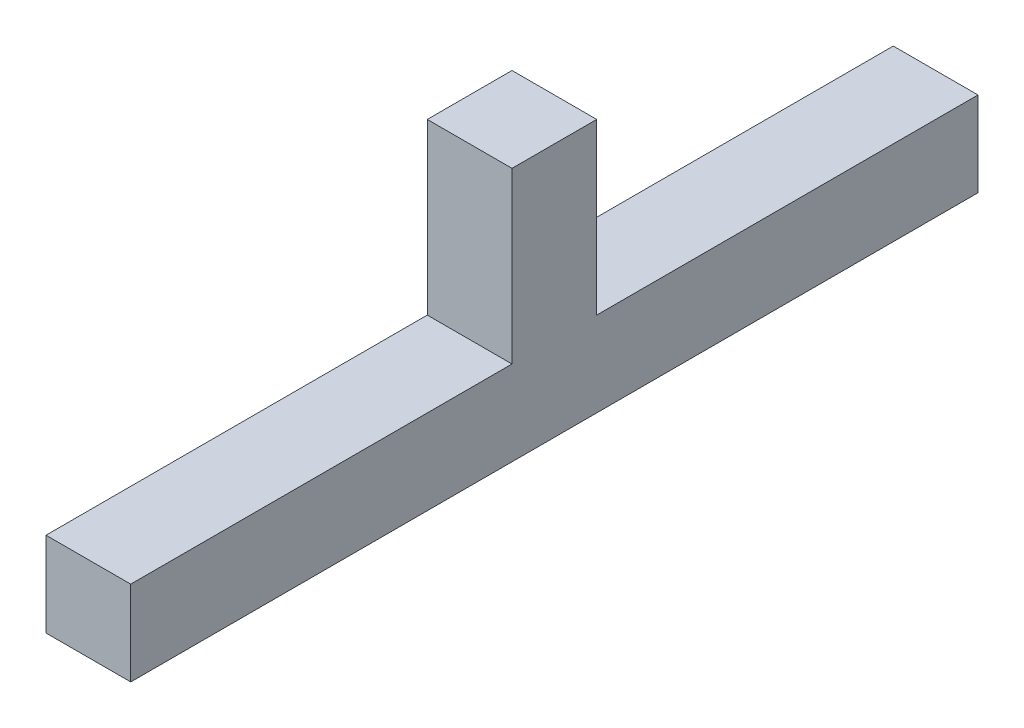
ISO-10303-21;
HEADER;
FILE_DESCRIPTION(('STEP AP214'),'2;1');
FILE_NAME('part.step','',(''),(''),'','','');
FILE_SCHEMA(('AUTOMOTIVE_DESIGN { 1 0 10303 214 1 1 1 1 }'));
ENDSEC;
DATA;
#1=APPLICATION_CONTEXT('core data for automotive mechanical design processes');
#2=APPLICATION_PROTOCOL_DEFINITION('international standard','automotive_design',2000,#1);
#3=PRODUCT_CONTEXT('',#1,'mechanical');
#4=PRODUCT('Part','Part','',(#3));
#5=PRODUCT_RELATED_PRODUCT_CATEGORY('part','',(#4));
#6=PRODUCT_DEFINITION_FORMATION('','',#4);
#7=PRODUCT_DEFINITION_CONTEXT('part definition',#1,'design');
#8=PRODUCT_DEFINITION('design','',#6,#7);
#9=PRODUCT_DEFINITION_SHAPE('','',#8);
#10=(LENGTH_UNIT() NAMED_UNIT(*) SI_UNIT(.MILLI.,.METRE.));
#11=(NAMED_UNIT(*) PLANE_ANGLE_UNIT() SI_UNIT($,.RADIAN.));
#12=(NAMED_UNIT(*) SI_UNIT($,.STERADIAN.) SOLID_ANGLE_UNIT());
#13=UNCERTAINTY_MEASURE_WITH_UNIT(LENGTH_MEASURE(1.E-05),#10,'distance_accuracy_value','');
#14=(GEOMETRIC_REPRESENTATION_CONTEXT(3) GLOBAL_UNCERTAINTY_ASSIGNED_CONTEXT((#13)) GLOBAL_UNIT_ASSIGNED_CONTEXT((#10,
#11,#12)) REPRESENTATION_CONTEXT('',''));
#15=CARTESIAN_POINT('',(0.,0.,0.));
#16=DIRECTION('',(0.,0.,1.));
#17=DIRECTION('',(1.,0.,0.));
#18=AXIS2_PLACEMENT_3D('',#15,#16,#17);
#19=CARTESIAN_POINT('',(5.,0.,0.));
#20=DIRECTION('',(0.,0.,1.));
#21=DIRECTION('',(1.,0.,0.));
#22=AXIS2_PLACEMENT_3D('',#19,#20,#21);
#23=PLANE('',#22);
#24=DIRECTION('',(0.,1.,0.));
#25=VECTOR('',#24,1.);
#26=CARTESIAN_POINT('',(0.,0.,0.));
#27=LINE('',#26,#25);
#28=CARTESIAN_POINT('',(0.,0.,0.));
#29=VERTEX_POINT('',#28);
#30=CARTESIAN_POINT('',(0.,5.,0.));
#31=VERTEX_POINT('',#30);
#32=EDGE_CURVE('E132',#29,#31,#27,.T.);
#33=ORIENTED_EDGE('',*,*,#32,.T.);
#34=DIRECTION('',(-1.,0.,0.));
#35=VECTOR('',#34,1.);
#36=CARTESIAN_POINT('',(5.,5.,0.));
#37=LINE('',#36,#35);
#38=CARTESIAN_POINT('',(5.,5.,0.));
#39=VERTEX_POINT('',#38);
#40=EDGE_CURVE('E11',#39,#31,#37,.T.);
#41=ORIENTED_EDGE('',*,*,#40,.F.);
#42=DIRECTION('',(0.,1.,0.));
#43=VECTOR('',#42,1.);
#44=CARTESIAN_POINT('',(5.,0.,0.));
#45=LINE('',#44,#43);
#46=CARTESIAN_POINT('',(5.,0.,0.));
#47=VERTEX_POINT('',#46);
#48=EDGE_CURVE('E146',#47,#39,#45,.T.);
#49=ORIENTED_EDGE('',*,*,#48,.F.);
#50=DIRECTION('',(-1.,0.,0.));
#51=VECTOR('',#50,1.);
#52=CARTESIAN_POINT('',(5.,0.,0.));
#53=LINE('',#52,#51);
#54=EDGE_CURVE('E128',#47,#29,#53,.T.);
#55=ORIENTED_EDGE('',*,*,#54,.T.);
#56=EDGE_LOOP('',(#33,#41,#49,#55));
#57=FACE_BOUND('',#56,.T.);
#58=ADVANCED_FACE('F36',(#57),#23,.F.);
#59=CARTESIAN_POINT('',(5.,5.,22.5));
#60=DIRECTION('',(0.,-1.,0.));
#61=DIRECTION('',(0.,0.,-1.));
#62=AXIS2_PLACEMENT_3D('',#59,#60,#61);
#63=PLANE('',#62);
#64=DIRECTION('',(0.,0.,1.));
#65=VECTOR('',#64,1.);
#66=CARTESIAN_POINT('',(0.,5.,22.5));
#67=LINE('',#66,#65);
#68=CARTESIAN_POINT('',(0.,5.,22.5));
#69=VERTEX_POINT('',#68);
#70=EDGE_CURVE('E135',#31,#69,#67,.T.);
#71=ORIENTED_EDGE('',*,*,#70,.T.);
#72=DIRECTION('',(-1.,0.,0.));
#73=VECTOR('',#72,1.);
#74=CARTESIAN_POINT('',(5.,5.,22.5));
#75=LINE('',#74,#73);
#76=CARTESIAN_POINT('',(5.,5.,22.5));
#77=VERTEX_POINT('',#76);
#78=EDGE_CURVE('E44',#77,#69,#75,.T.);
#79=ORIENTED_EDGE('',*,*,#78,.F.);
#80=DIRECTION('',(0.,0.,1.));
#81=VECTOR('',#80,1.);
#82=CARTESIAN_POINT('',(5.,5.,22.5));
#83=LINE('',#82,#81);
#84=EDGE_CURVE('E95',#39,#77,#83,.T.);
#85=ORIENTED_EDGE('',*,*,#84,.F.);
#86=ORIENTED_EDGE('',*,*,#40,.T.);
#87=EDGE_LOOP('',(#71,#79,#85,#86));
#88=FACE_BOUND('',#87,.T.);
#89=ADVANCED_FACE('F181',(#88),#63,.F.);
#90=CARTESIAN_POINT('',(5.,15.,22.5));
#91=DIRECTION('',(0.,0.,1.));
#92=DIRECTION('',(1.,0.,0.));
#93=AXIS2_PLACEMENT_3D('',#90,#91,#92);
#94=PLANE('',#93);
#95=DIRECTION('',(0.,1.,0.));
#96=VECTOR('',#95,1.);
#97=CARTESIAN_POINT('',(0.,15.,22.5));
#98=LINE('',#97,#96);
#99=CARTESIAN_POINT('',(0.,15.,22.5));
#100=VERTEX_POINT('',#99);
#101=EDGE_CURVE('E137',#69,#100,#98,.T.);
#102=ORIENTED_EDGE('',*,*,#101,.T.);
#103=DIRECTION('',(-1.,0.,0.));
#104=VECTOR('',#103,1.);
#105=CARTESIAN_POINT('',(5.,15.,22.5));
#106=LINE('',#105,#104);
#107=CARTESIAN_POINT('',(5.,15.,22.5));
#108=VERTEX_POINT('',#107);
#109=EDGE_CURVE('E153',#108,#100,#106,.T.);
#110=ORIENTED_EDGE('',*,*,#109,.F.);
#111=DIRECTION('',(0.,1.,0.));
#112=VECTOR('',#111,1.);
#113=CARTESIAN_POINT('',(5.,15.,22.5));
#114=LINE('',#113,#112);
#115=EDGE_CURVE('E161',#77,#108,#114,.T.);
#116=ORIENTED_EDGE('',*,*,#115,.F.);
#117=ORIENTED_EDGE('',*,*,#78,.T.);
#118=EDGE_LOOP('',(#102,#110,#116,#117));
#119=FACE_BOUND('',#118,.T.);
#120=ADVANCED_FACE('F159',(#119),#94,.F.);
#121=CARTESIAN_POINT('',(5.,15.,22.5));
#122=DIRECTION('',(0.,-1.,0.));
#123=DIRECTION('',(0.,0.,-1.));
#124=AXIS2_PLACEMENT_3D('',#121,#122,#123);
#125=PLANE('',#124);
#126=DIRECTION('',(0.,0.,1.));
#127=VECTOR('',#126,1.);
#128=CARTESIAN_POINT('',(0.,15.,22.5));
#129=LINE('',#128,#127);
#130=CARTESIAN_POINT('',(0.,15.,27.5));
#131=VERTEX_POINT('',#130);
#132=EDGE_CURVE('E139',#100,#131,#129,.T.);
#133=ORIENTED_EDGE('',*,*,#132,.T.);
#134=DIRECTION('',(-1.,0.,0.));
#135=VECTOR('',#134,1.);
#136=CARTESIAN_POINT('',(5.,15.,27.5));
#137=LINE('',#136,#135);
#138=CARTESIAN_POINT('',(5.,15.,27.5));
#139=VERTEX_POINT('',#138);
#140=EDGE_CURVE('E150',#139,#131,#137,.T.);
#141=ORIENTED_EDGE('',*,*,#140,.F.);
#142=DIRECTION('',(0.,0.,1.));
#143=VECTOR('',#142,1.);
#144=CARTESIAN_POINT('',(5.,15.,22.5));
#145=LINE('',#144,#143);
#146=EDGE_CURVE('E173',#108,#139,#145,.T.);
#147=ORIENTED_EDGE('',*,*,#146,.F.);
#148=ORIENTED_EDGE('',*,*,#109,.T.);
#149=EDGE_LOOP('',(#133,#141,#147,#148));
#150=FACE_BOUND('',#149,.T.);
#151=ADVANCED_FACE('F169',(#150),#125,.F.);
#152=CARTESIAN_POINT('',(5.,4.99999999999999,27.5));
#153=DIRECTION('',(0.,0.,-1.));
#154=DIRECTION('',(-1.,0.,0.));
#155=AXIS2_PLACEMENT_3D('',#152,#153,#154);
#156=PLANE('',#155);
#157=DIRECTION('',(0.,-1.,0.));
#158=VECTOR('',#157,1.);
#159=CARTESIAN_POINT('',(0.,4.99999999999999,27.5));
#160=LINE('',#159,#158);
#161=CARTESIAN_POINT('',(0.,4.99999999999999,27.5));
#162=VERTEX_POINT('',#161);
#163=EDGE_CURVE('E141',#131,#162,#160,.T.);
#164=ORIENTED_EDGE('',*,*,#163,.T.);
#165=DIRECTION('',(-1.,0.,0.));
#166=VECTOR('',#165,1.);
#167=CARTESIAN_POINT('',(5.,4.99999999999999,27.5));
#168=LINE('',#167,#166);
#169=CARTESIAN_POINT('',(5.,4.99999999999999,27.5));
#170=VERTEX_POINT('',#169);
#171=EDGE_CURVE('E123',#170,#162,#168,.T.);
#172=ORIENTED_EDGE('',*,*,#171,.F.);
#173=DIRECTION('',(0.,-1.,0.));
#174=VECTOR('',#173,1.);
#175=CARTESIAN_POINT('',(5.,4.99999999999999,27.5));
#176=LINE('',#175,#174);
#177=EDGE_CURVE('E114',#139,#170,#176,.T.);
#178=ORIENTED_EDGE('',*,*,#177,.F.);
#179=ORIENTED_EDGE('',*,*,#140,.T.);
#180=EDGE_LOOP('',(#164,#172,#178,#179));
#181=FACE_BOUND('',#180,.T.);
#182=ADVANCED_FACE('F172',(#181),#156,.F.);
#183=CARTESIAN_POINT('',(5.,4.99999999999999,50.));
#184=DIRECTION('',(0.,-1.,0.));
#185=DIRECTION('',(0.,0.,-1.));
#186=AXIS2_PLACEMENT_3D('',#183,#184,#185);
#187=PLANE('',#186);
#188=DIRECTION('',(0.,0.,1.));
#189=VECTOR('',#188,1.);
#190=CARTESIAN_POINT('',(0.,4.99999999999999,50.));
#191=LINE('',#190,#189);
#192=CARTESIAN_POINT('',(0.,4.99999999999999,50.));
#193=VERTEX_POINT('',#192);
#194=EDGE_CURVE('E122',#162,#193,#191,.T.);
#195=ORIENTED_EDGE('',*,*,#194,.T.);
#196=DIRECTION('',(-1.,0.,0.));
#197=VECTOR('',#196,1.);
#198=CARTESIAN_POINT('',(5.,4.99999999999999,50.));
#199=LINE('',#198,#197);
#200=CARTESIAN_POINT('',(5.,4.99999999999999,50.));
#201=VERTEX_POINT('',#200);
#202=EDGE_CURVE('E119',#201,#193,#199,.T.);
#203=ORIENTED_EDGE('',*,*,#202,.F.);
#204=DIRECTION('',(0.,0.,1.));
#205=VECTOR('',#204,1.);
#206=CARTESIAN_POINT('',(5.,4.99999999999999,50.));
#207=LINE('',#206,#205);
#208=EDGE_CURVE('E108',#170,#201,#207,.T.);
#209=ORIENTED_EDGE('',*,*,#208,.F.);
#210=ORIENTED_EDGE('',*,*,#171,.T.);
#211=EDGE_LOOP('',(#195,#203,#209,#210));
#212=FACE_BOUND('',#211,.T.);
#213=ADVANCED_FACE('F120',(#212),#187,.F.);
#214=CARTESIAN_POINT('',(5.,0.,50.));
#215=DIRECTION('',(0.,0.,-1.));
#216=DIRECTION('',(-1.,0.,0.));
#217=AXIS2_PLACEMENT_3D('',#214,#215,#216);
#218=PLANE('',#217);
#219=DIRECTION('',(0.,-1.,0.));
#220=VECTOR('',#219,1.);
#221=CARTESIAN_POINT('',(0.,0.,50.));
#222=LINE('',#221,#220);
#223=CARTESIAN_POINT('',(0.,0.,50.));
#224=VERTEX_POINT('',#223);
#225=EDGE_CURVE('E81',#193,#224,#222,.T.);
#226=ORIENTED_EDGE('',*,*,#225,.T.);
#227=DIRECTION('',(-1.,0.,0.));
#228=VECTOR('',#227,1.);
#229=CARTESIAN_POINT('',(5.,0.,50.));
#230=LINE('',#229,#228);
#231=CARTESIAN_POINT('',(5.,0.,50.));
#232=VERTEX_POINT('',#231);
#233=EDGE_CURVE('E124',#232,#224,#230,.T.);
#234=ORIENTED_EDGE('',*,*,#233,.F.);
#235=DIRECTION('',(0.,-1.,0.));
#236=VECTOR('',#235,1.);
#237=CARTESIAN_POINT('',(5.,0.,50.));
#238=LINE('',#237,#236);
#239=EDGE_CURVE('E112',#201,#232,#238,.T.);
#240=ORIENTED_EDGE('',*,*,#239,.F.);
#241=ORIENTED_EDGE('',*,*,#202,.T.);
#242=EDGE_LOOP('',(#226,#234,#240,#241));
#243=FACE_BOUND('',#242,.T.);
#244=ADVANCED_FACE('F126',(#243),#218,.F.);
#245=CARTESIAN_POINT('',(5.,0.,0.));
#246=DIRECTION('',(0.,1.,0.));
#247=DIRECTION('',(0.,0.,1.));
#248=AXIS2_PLACEMENT_3D('',#245,#246,#247);
#249=PLANE('',#248);
#250=DIRECTION('',(0.,0.,-1.));
#251=VECTOR('',#250,1.);
#252=CARTESIAN_POINT('',(0.,0.,0.));
#253=LINE('',#252,#251);
#254=EDGE_CURVE('E87',#224,#29,#253,.T.);
#255=ORIENTED_EDGE('',*,*,#254,.T.);
#256=ORIENTED_EDGE('',*,*,#54,.F.);
#257=DIRECTION('',(0.,0.,-1.));
#258=VECTOR('',#257,1.);
#259=CARTESIAN_POINT('',(5.,0.,0.));
#260=LINE('',#259,#258);
#261=EDGE_CURVE('E52',#232,#47,#260,.T.);
#262=ORIENTED_EDGE('',*,*,#261,.F.);
#263=ORIENTED_EDGE('',*,*,#233,.T.);
#264=EDGE_LOOP('',(#255,#256,#262,#263));
#265=FACE_BOUND('',#264,.T.);
#266=ADVANCED_FACE('F197',(#265),#249,.F.);
#267=CARTESIAN_POINT('',(5.,0.,0.));
#268=DIRECTION('',(-1.,0.,0.));
#269=DIRECTION('',(0.,0.,1.));
#270=AXIS2_PLACEMENT_3D('',#267,#268,#269);
#271=PLANE('',#270);
#272=ORIENTED_EDGE('',*,*,#48,.T.);
#273=ORIENTED_EDGE('',*,*,#84,.T.);
#274=ORIENTED_EDGE('',*,*,#115,.T.);
#275=ORIENTED_EDGE('',*,*,#146,.T.);
#276=ORIENTED_EDGE('',*,*,#177,.T.);
#277=ORIENTED_EDGE('',*,*,#208,.T.);
#278=ORIENTED_EDGE('',*,*,#239,.T.);
#279=ORIENTED_EDGE('',*,*,#261,.T.);
#280=EDGE_LOOP('',(#272,#273,#274,#275,#276,#277,#278,#279));
#281=FACE_BOUND('',#280,.T.);
#282=ADVANCED_FACE('F110',(#281),#271,.F.);
#283=CARTESIAN_POINT('',(0.,0.,0.));
#284=DIRECTION('',(-1.,0.,0.));
#285=DIRECTION('',(0.,0.,1.));
#286=AXIS2_PLACEMENT_3D('',#283,#284,#285);
#287=PLANE('',#286);
#288=ORIENTED_EDGE('',*,*,#32,.F.);
#289=ORIENTED_EDGE('',*,*,#254,.F.);
#290=ORIENTED_EDGE('',*,*,#225,.F.);
#291=ORIENTED_EDGE('',*,*,#194,.F.);
#292=ORIENTED_EDGE('',*,*,#163,.F.);
#293=ORIENTED_EDGE('',*,*,#132,.F.);
#294=ORIENTED_EDGE('',*,*,#101,.F.);
#295=ORIENTED_EDGE('',*,*,#70,.F.);
#296=EDGE_LOOP('',(#288,#289,#290,#291,#292,#293,#294,#295));
#297=FACE_BOUND('',#296,.T.);
#298=ADVANCED_FACE('F165',(#297),#287,.T.);
#299=CLOSED_SHELL('',(#58,#89,#120,#151,#182,#213,#244,#266,#282,#298));
#300=MANIFOLD_SOLID_BREP('B2',#299);
#301=ADVANCED_BREP_SHAPE_REPRESENTATION('',(#18,#300),#14);
#302=SHAPE_DEFINITION_REPRESENTATION(#9,#301);
ENDSEC;
END-ISO-10303-21;
